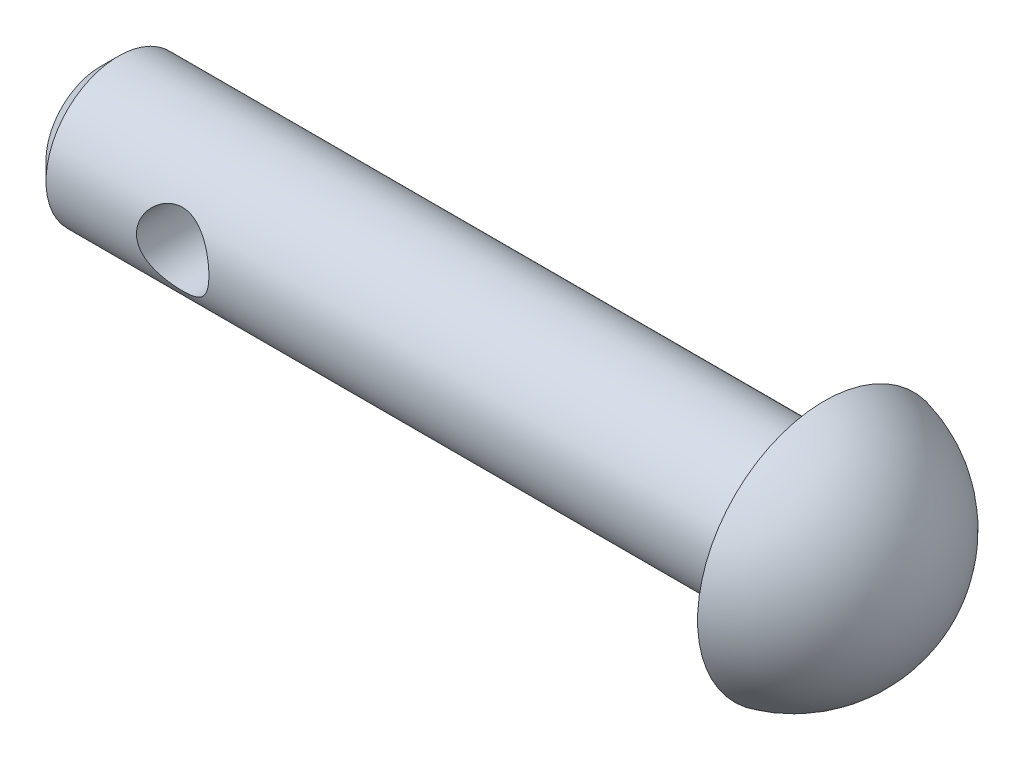
ISO-10303-21;
HEADER;
FILE_DESCRIPTION(('STEP AP214'),'2;1');
FILE_NAME('part.step','',(''),(''),'','','');
FILE_SCHEMA(('AUTOMOTIVE_DESIGN { 1 0 10303 214 1 1 1 1 }'));
ENDSEC;
DATA;
#1=APPLICATION_CONTEXT('core data for automotive mechanical design processes');
#2=APPLICATION_PROTOCOL_DEFINITION('international standard','automotive_design',2000,#1);
#3=PRODUCT_CONTEXT('',#1,'mechanical');
#4=PRODUCT('Part','Part','',(#3));
#5=PRODUCT_RELATED_PRODUCT_CATEGORY('part','',(#4));
#6=PRODUCT_DEFINITION_FORMATION('','',#4);
#7=PRODUCT_DEFINITION_CONTEXT('part definition',#1,'design');
#8=PRODUCT_DEFINITION('design','',#6,#7);
#9=PRODUCT_DEFINITION_SHAPE('','',#8);
#10=(LENGTH_UNIT() NAMED_UNIT(*) SI_UNIT(.MILLI.,.METRE.));
#11=(NAMED_UNIT(*) PLANE_ANGLE_UNIT() SI_UNIT($,.RADIAN.));
#12=(NAMED_UNIT(*) SI_UNIT($,.STERADIAN.) SOLID_ANGLE_UNIT());
#13=UNCERTAINTY_MEASURE_WITH_UNIT(LENGTH_MEASURE(1.E-05),#10,'distance_accuracy_value','');
#14=(GEOMETRIC_REPRESENTATION_CONTEXT(3) GLOBAL_UNCERTAINTY_ASSIGNED_CONTEXT((#13)) GLOBAL_UNIT_ASSIGNED_CONTEXT((#10,
#11,#12)) REPRESENTATION_CONTEXT('',''));
#15=CARTESIAN_POINT('',(0.,0.,0.));
#16=DIRECTION('',(0.,0.,1.));
#17=DIRECTION('',(1.,0.,0.));
#18=AXIS2_PLACEMENT_3D('',#15,#16,#17);
#19=CARTESIAN_POINT('',(-20.,0.,0.));
#20=DIRECTION('',(1.,0.,0.));
#21=DIRECTION('',(0.,0.,-1.));
#22=AXIS2_PLACEMENT_3D('',#19,#20,#21);
#23=CYLINDRICAL_SURFACE('',#22,2.);
#24=CARTESIAN_POINT('',(-19.5,0.,0.));
#25=DIRECTION('',(1.,0.,0.));
#26=DIRECTION('',(0.,0.,-1.));
#27=AXIS2_PLACEMENT_3D('',#24,#25,#26);
#28=CIRCLE('',#27,2.);
#29=CARTESIAN_POINT('',(-19.5,0.,-2.));
#30=VERTEX_POINT('',#29);
#31=EDGE_CURVE('E39',#30,#30,#28,.T.);
#32=ORIENTED_EDGE('',*,*,#31,.T.);
#33=EDGE_LOOP('',(#32));
#34=FACE_BOUND('',#33,.T.);
#35=CARTESIAN_POINT('',(-15.,0.,-2.));
#36=CARTESIAN_POINT('',(-15.0000033023195,-0.0525719629529865,-1.99999713404151));
#37=CARTESIAN_POINT('',(-15.0041700731217,-0.105206599698033,-1.99790491019518));
#38=CARTESIAN_POINT('',(-15.0206528803409,-0.208920235268425,-1.98974156037396));
#39=CARTESIAN_POINT('',(-15.0329843929976,-0.259996086713504,-1.98366287828984));
#40=CARTESIAN_POINT('',(-15.0651938086168,-0.358933544880575,-1.96816279403312));
#41=CARTESIAN_POINT('',(-15.085042384248,-0.406806802939181,-1.9587543917752));
#42=CARTESIAN_POINT('',(-15.1315706213649,-0.498472616806566,-1.93745776515779));
#43=CARTESIAN_POINT('',(-15.1582497442489,-0.54226549399005,-1.9255697363353));
#44=CARTESIAN_POINT('',(-15.2195172494853,-0.62750781776192,-1.89956258258057));
#45=CARTESIAN_POINT('',(-15.2544864792396,-0.668655211122113,-1.88535199127536));
#46=CARTESIAN_POINT('',(-15.330521479247,-0.744779444866978,-1.85659970246744));
#47=CARTESIAN_POINT('',(-15.3715918517724,-0.779751583106767,-1.84205776209035));
#48=CARTESIAN_POINT('',(-15.4624833495234,-0.84525200045028,-1.81298951197347));
#49=CARTESIAN_POINT('',(-15.5127360983459,-0.875225335551638,-1.79855186970132));
#50=CARTESIAN_POINT('',(-15.6183673359862,-0.926168226890696,-1.77285978772321));
#51=CARTESIAN_POINT('',(-15.6737421287227,-0.947144214966335,-1.7616030760699));
#52=CARTESIAN_POINT('',(-15.7846651054219,-0.97813244218859,-1.74457867037808));
#53=CARTESIAN_POINT('',(-15.8400044520674,-0.988725857080443,-1.73852271583713));
#54=CARTESIAN_POINT('',(-15.9519788377795,-1.00042699330885,-1.73181889948528));
#55=CARTESIAN_POINT('',(-16.0086125408712,-1.00154408837308,-1.73116569343288));
#56=CARTESIAN_POINT('',(-16.1142860243154,-0.994687287172296,-1.73510930257248));
#57=CARTESIAN_POINT('',(-16.163424031223,-0.987784559536823,-1.73908763662013));
#58=CARTESIAN_POINT('',(-16.259721909373,-0.966939849056935,-1.7507622873385));
#59=CARTESIAN_POINT('',(-16.3068811453053,-0.952995623897654,-1.75845978831776));
#60=CARTESIAN_POINT('',(-16.3992291325657,-0.918209780386006,-1.77687476412741));
#61=CARTESIAN_POINT('',(-16.4443463987858,-0.897215067115997,-1.78765840663998));
#62=CARTESIAN_POINT('',(-16.53063429259,-0.849041687668004,-1.81103404281404));
#63=CARTESIAN_POINT('',(-16.5718031356001,-0.821860243812469,-1.8236268478019));
#64=CARTESIAN_POINT('',(-16.6545212527432,-0.75806605491279,-1.85113157903286));
#65=CARTESIAN_POINT('',(-16.6954568735762,-0.720694458369283,-1.86613510236746));
#66=CARTESIAN_POINT('',(-16.7707354185909,-0.639555578741374,-1.89547623300407));
#67=CARTESIAN_POINT('',(-16.8050751920339,-0.595785256574287,-1.90981351958801));
#68=CARTESIAN_POINT('',(-16.8676856610297,-0.50051650583185,-1.93701987282964));
#69=CARTESIAN_POINT('',(-16.8956004724457,-0.448753591599411,-1.94978984162007));
#70=CARTESIAN_POINT('',(-16.942097029043,-0.340466215488799,-1.97157881121242));
#71=CARTESIAN_POINT('',(-16.9606861850152,-0.283945576265279,-1.98060078943553));
#72=CARTESIAN_POINT('',(-16.9864754037167,-0.172766491660705,-1.99324333741436));
#73=CARTESIAN_POINT('',(-16.9944912357468,-0.118341530548327,-1.99724938301312));
#74=CARTESIAN_POINT('',(-17.0014647311345,-0.00877959994935651,-2.00073013459102));
#75=CARTESIAN_POINT('',(-17.0004266856395,0.0463570198698988,-2.00020698721312));
#76=CARTESIAN_POINT('',(-16.9897933115812,0.151232971985991,-1.99491192253441));
#77=CARTESIAN_POINT('',(-16.98086746727,0.201059408049952,-1.9904724568819));
#78=CARTESIAN_POINT('',(-16.9557619281049,0.298406892301915,-1.97822171314819));
#79=CARTESIAN_POINT('',(-16.9395814335466,0.345927685690995,-1.97041006334332));
#80=CARTESIAN_POINT('',(-16.9000015335668,0.438888608449664,-1.95184251413669));
#81=CARTESIAN_POINT('',(-16.8764089498832,0.484230397006153,-1.94100881769939));
#82=CARTESIAN_POINT('',(-16.822892464354,0.570461361698921,-1.91743974317109));
#83=CARTESIAN_POINT('',(-16.7929658654066,0.611348629775281,-1.90470355565785));
#84=CARTESIAN_POINT('',(-16.7242395746671,0.691767689290653,-1.87708221337464));
#85=CARTESIAN_POINT('',(-16.6848571315464,0.730772077824639,-1.86210884848441));
#86=CARTESIAN_POINT('',(-16.6000748487307,0.80185632111324,-1.83262391603874));
#87=CARTESIAN_POINT('',(-16.5546708811836,0.833931385690841,-1.81811267381526));
#88=CARTESIAN_POINT('',(-16.4563563457997,0.891707914497694,-1.79051192226068));
#89=CARTESIAN_POINT('',(-16.4031887337914,0.917025495878636,-1.77752529663472));
#90=CARTESIAN_POINT('',(-16.2924899323075,0.958082826013803,-1.75574072368126));
#91=CARTESIAN_POINT('',(-16.2349644734988,0.97383491588757,-1.74693738240618));
#92=CARTESIAN_POINT('',(-16.1230897771386,0.99386168744968,-1.73561501008667));
#93=CARTESIAN_POINT('',(-16.068965746571,0.999092996400866,-1.73257383460491));
#94=CARTESIAN_POINT('',(-15.9605529328293,1.00068915438079,-1.73165354646175));
#95=CARTESIAN_POINT('',(-15.9062642312606,0.997057846624401,-1.73377219627552));
#96=CARTESIAN_POINT('',(-15.804516498468,0.981926125592265,-1.74237862050025));
#97=CARTESIAN_POINT('',(-15.7568995298556,0.971208314342801,-1.74843094482394));
#98=CARTESIAN_POINT('',(-15.6641918805753,0.943175358224647,-1.76371016187917));
#99=CARTESIAN_POINT('',(-15.619102017908,0.925858091159812,-1.77293807569675));
#100=CARTESIAN_POINT('',(-15.5293751490134,0.883815745300685,-1.79428530364528));
#101=CARTESIAN_POINT('',(-15.4849720981703,0.85867113781646,-1.8065572239619));
#102=CARTESIAN_POINT('',(-15.4007254638194,0.802150971636636,-1.8323533163459));
#103=CARTESIAN_POINT('',(-15.3608842694815,0.77077217123865,-1.84587813794522));
#104=CARTESIAN_POINT('',(-15.2818580176424,0.698203326664643,-1.87462323159313));
#105=CARTESIAN_POINT('',(-15.2433408976381,0.656284423010173,-1.88984983311469));
#106=CARTESIAN_POINT('',(-15.1737370165764,0.566154806220281,-1.91877752255088));
#107=CARTESIAN_POINT('',(-15.1426542605737,0.517940723256786,-1.9324777860804));
#108=CARTESIAN_POINT('',(-15.0887636372378,0.415931596819949,-1.95698009585103));
#109=CARTESIAN_POINT('',(-15.0660158305886,0.362099503934616,-1.96776096562909));
#110=CARTESIAN_POINT('',(-15.030191832081,0.250742101294193,-1.98501341363465));
#111=CARTESIAN_POINT('',(-15.0170881531704,0.193227799623168,-1.99149723372932));
#112=CARTESIAN_POINT('',(-15.0061025889241,0.112601946483386,-1.99695461909663));
#113=CARTESIAN_POINT('',(-15.0038173591364,0.0901618794395003,-1.99809365339202));
#114=CARTESIAN_POINT('',(-15.0007653344832,0.0451517318071585,-1.99961696977865));
#115=CARTESIAN_POINT('',(-14.9999985815288,0.0225816476473818,-2.00000123103763));
#116=CARTESIAN_POINT('',(-15.,0.,-2.));
#117=B_SPLINE_CURVE_WITH_KNOTS('',3,(#35,#36,#37,#38,#39,#40,#41,#42,#43,#44,#45,#46,#47,#48,
#49,#50,#51,#52,#53,#54,#55,#56,#57,#58,#59,#60,#61,#62,#63,#64,#65,#66,#67,#68,#69,#70,#71,#72,
#73,#74,#75,#76,#77,#78,#79,#80,#81,#82,#83,#84,#85,#86,#87,#88,#89,#90,#91,#92,#93,#94,#95,#96,
#97,#98,#99,#100,#101,#102,#103,#104,#105,#106,#107,#108,#109,#110,#111,#112,#113,#114,#115,
#116),.UNSPECIFIED.,.T.,.F.,(4,2,2,2,2,2,2,2,2,2,2,2,2,2,2,2,2,2,2,2,2,2,2,2,2,2,2,2,2,2,2,2,2,
2,2,2,2,2,2,2,4),(0.,0.157624257420293,0.315548149709198,0.472862155492299,0.630163760581568,
0.79698175871809,0.963926237654036,1.14381726430753,1.32357947898281,1.4925801214023,
1.6614135732902,1.8100571240932,1.95874803925678,2.11090240168487,2.26312521260222,
2.43464941333879,2.60625534598687,2.78583022214441,2.9652621691228,3.12983290471346,
3.29432564511476,3.44606906506122,3.59782921630932,3.75392856027899,3.9100945074834,
4.08159610644419,4.25321588615432,4.43314682159674,4.61284511940778,4.77529307498374,
4.93767059860006,5.08457930244183,5.23153528783678,5.38836456775615,5.54527561138958,
5.72125242752499,5.89732383376573,6.07464013662926,6.25144908624931,6.31915280137698,
6.38685838514848),.UNSPECIFIED.);
#118=CARTESIAN_POINT('',(-15.,0.,-2.));
#119=VERTEX_POINT('',#118);
#120=EDGE_CURVE('E43',#119,#119,#117,.T.);
#121=ORIENTED_EDGE('',*,*,#120,.F.);
#122=EDGE_LOOP('',(#121));
#123=FACE_BOUND('',#122,.T.);
#124=CARTESIAN_POINT('',(-15.,0.,2.));
#125=CARTESIAN_POINT('',(-15.0000033023195,0.0525719629529865,1.99999713404151));
#126=CARTESIAN_POINT('',(-15.0041700731217,0.105206599698033,1.99790491019518));
#127=CARTESIAN_POINT('',(-15.0206528803409,0.208920235268425,1.98974156037396));
#128=CARTESIAN_POINT('',(-15.0329843929976,0.259996086713504,1.98366287828984));
#129=CARTESIAN_POINT('',(-15.0651938086168,0.358933544880575,1.96816279403312));
#130=CARTESIAN_POINT('',(-15.085042384248,0.406806802939181,1.9587543917752));
#131=CARTESIAN_POINT('',(-15.1315706213649,0.498472616806566,1.93745776515779));
#132=CARTESIAN_POINT('',(-15.1582497442489,0.54226549399005,1.9255697363353));
#133=CARTESIAN_POINT('',(-15.2195172494853,0.62750781776192,1.89956258258057));
#134=CARTESIAN_POINT('',(-15.2544864792396,0.668655211122113,1.88535199127536));
#135=CARTESIAN_POINT('',(-15.330521479247,0.744779444866978,1.85659970246744));
#136=CARTESIAN_POINT('',(-15.3715918517724,0.779751583106767,1.84205776209035));
#137=CARTESIAN_POINT('',(-15.4624833495234,0.84525200045028,1.81298951197347));
#138=CARTESIAN_POINT('',(-15.5127360983459,0.875225335551638,1.79855186970132));
#139=CARTESIAN_POINT('',(-15.6183673359862,0.926168226890696,1.77285978772321));
#140=CARTESIAN_POINT('',(-15.6737421287227,0.947144214966335,1.7616030760699));
#141=CARTESIAN_POINT('',(-15.7846651054219,0.97813244218859,1.74457867037808));
#142=CARTESIAN_POINT('',(-15.8400044520674,0.988725857080443,1.73852271583713));
#143=CARTESIAN_POINT('',(-15.9519788377795,1.00042699330885,1.73181889948528));
#144=CARTESIAN_POINT('',(-16.0086125408712,1.00154408837308,1.73116569343288));
#145=CARTESIAN_POINT('',(-16.1142860243154,0.994687287172296,1.73510930257248));
#146=CARTESIAN_POINT('',(-16.163424031223,0.987784559536823,1.73908763662013));
#147=CARTESIAN_POINT('',(-16.259721909373,0.966939849056935,1.7507622873385));
#148=CARTESIAN_POINT('',(-16.3068811453053,0.952995623897654,1.75845978831776));
#149=CARTESIAN_POINT('',(-16.3992291325657,0.918209780386006,1.77687476412741));
#150=CARTESIAN_POINT('',(-16.4443463987858,0.897215067115997,1.78765840663998));
#151=CARTESIAN_POINT('',(-16.53063429259,0.849041687668004,1.81103404281404));
#152=CARTESIAN_POINT('',(-16.5718031356001,0.821860243812469,1.8236268478019));
#153=CARTESIAN_POINT('',(-16.6545212527432,0.75806605491279,1.85113157903286));
#154=CARTESIAN_POINT('',(-16.6954568735762,0.720694458369283,1.86613510236746));
#155=CARTESIAN_POINT('',(-16.7707354185909,0.639555578741374,1.89547623300407));
#156=CARTESIAN_POINT('',(-16.8050751920339,0.595785256574287,1.90981351958801));
#157=CARTESIAN_POINT('',(-16.8676856610297,0.50051650583185,1.93701987282964));
#158=CARTESIAN_POINT('',(-16.8956004724457,0.448753591599411,1.94978984162007));
#159=CARTESIAN_POINT('',(-16.942097029043,0.340466215488799,1.97157881121242));
#160=CARTESIAN_POINT('',(-16.9606861850152,0.283945576265279,1.98060078943553));
#161=CARTESIAN_POINT('',(-16.9864754037167,0.172766491660705,1.99324333741436));
#162=CARTESIAN_POINT('',(-16.9944912357468,0.118341530548327,1.99724938301312));
#163=CARTESIAN_POINT('',(-17.0014647311345,0.00877959994935651,2.00073013459102));
#164=CARTESIAN_POINT('',(-17.0004266856395,-0.0463570198698988,2.00020698721312));
#165=CARTESIAN_POINT('',(-16.9897933115812,-0.151232971985991,1.99491192253441));
#166=CARTESIAN_POINT('',(-16.98086746727,-0.201059408049952,1.9904724568819));
#167=CARTESIAN_POINT('',(-16.9557619281049,-0.298406892301915,1.97822171314819));
#168=CARTESIAN_POINT('',(-16.9395814335466,-0.345927685690995,1.97041006334332));
#169=CARTESIAN_POINT('',(-16.9000015335668,-0.438888608449664,1.95184251413669));
#170=CARTESIAN_POINT('',(-16.8764089498832,-0.484230397006153,1.94100881769939));
#171=CARTESIAN_POINT('',(-16.822892464354,-0.570461361698921,1.91743974317109));
#172=CARTESIAN_POINT('',(-16.7929658654066,-0.611348629775281,1.90470355565785));
#173=CARTESIAN_POINT('',(-16.7242395746671,-0.691767689290653,1.87708221337464));
#174=CARTESIAN_POINT('',(-16.6848571315464,-0.730772077824639,1.86210884848441));
#175=CARTESIAN_POINT('',(-16.6000748487307,-0.80185632111324,1.83262391603874));
#176=CARTESIAN_POINT('',(-16.5546708811836,-0.833931385690841,1.81811267381526));
#177=CARTESIAN_POINT('',(-16.4563563457997,-0.891707914497694,1.79051192226068));
#178=CARTESIAN_POINT('',(-16.4031887337914,-0.917025495878636,1.77752529663472));
#179=CARTESIAN_POINT('',(-16.2924899323075,-0.958082826013803,1.75574072368126));
#180=CARTESIAN_POINT('',(-16.2349644734988,-0.97383491588757,1.74693738240618));
#181=CARTESIAN_POINT('',(-16.1230897771386,-0.99386168744968,1.73561501008667));
#182=CARTESIAN_POINT('',(-16.068965746571,-0.999092996400866,1.73257383460491));
#183=CARTESIAN_POINT('',(-15.9605529328293,-1.00068915438079,1.73165354646175));
#184=CARTESIAN_POINT('',(-15.9062642312606,-0.997057846624401,1.73377219627552));
#185=CARTESIAN_POINT('',(-15.804516498468,-0.981926125592265,1.74237862050025));
#186=CARTESIAN_POINT('',(-15.7568995298556,-0.971208314342801,1.74843094482394));
#187=CARTESIAN_POINT('',(-15.6641918805753,-0.943175358224647,1.76371016187917));
#188=CARTESIAN_POINT('',(-15.619102017908,-0.925858091159812,1.77293807569675));
#189=CARTESIAN_POINT('',(-15.5293751490134,-0.883815745300685,1.79428530364528));
#190=CARTESIAN_POINT('',(-15.4849720981703,-0.85867113781646,1.8065572239619));
#191=CARTESIAN_POINT('',(-15.4007254638194,-0.802150971636636,1.8323533163459));
#192=CARTESIAN_POINT('',(-15.3608842694815,-0.77077217123865,1.84587813794522));
#193=CARTESIAN_POINT('',(-15.2818580176424,-0.698203326664643,1.87462323159313));
#194=CARTESIAN_POINT('',(-15.2433408976381,-0.656284423010173,1.88984983311469));
#195=CARTESIAN_POINT('',(-15.1737370165764,-0.566154806220281,1.91877752255088));
#196=CARTESIAN_POINT('',(-15.1426542605737,-0.517940723256786,1.9324777860804));
#197=CARTESIAN_POINT('',(-15.0887636372378,-0.415931596819949,1.95698009585103));
#198=CARTESIAN_POINT('',(-15.0660158305886,-0.362099503934616,1.96776096562909));
#199=CARTESIAN_POINT('',(-15.030191832081,-0.250742101294193,1.98501341363465));
#200=CARTESIAN_POINT('',(-15.0170881531704,-0.193227799623168,1.99149723372932));
#201=CARTESIAN_POINT('',(-15.0061025889241,-0.112601946483386,1.99695461909663));
#202=CARTESIAN_POINT('',(-15.0038173591364,-0.0901618794395003,1.99809365339202));
#203=CARTESIAN_POINT('',(-15.0007653344832,-0.0451517318071585,1.99961696977865));
#204=CARTESIAN_POINT('',(-14.9999985815288,-0.0225816476473818,2.00000123103763));
#205=CARTESIAN_POINT('',(-15.,0.,2.));
#206=B_SPLINE_CURVE_WITH_KNOTS('',3,(#124,#125,#126,#127,#128,#129,#130,#131,#132,#133,#134,
#135,#136,#137,#138,#139,#140,#141,#142,#143,#144,#145,#146,#147,#148,#149,#150,#151,#152,#153,
#154,#155,#156,#157,#158,#159,#160,#161,#162,#163,#164,#165,#166,#167,#168,#169,#170,#171,#172,
#173,#174,#175,#176,#177,#178,#179,#180,#181,#182,#183,#184,#185,#186,#187,#188,#189,#190,#191,
#192,#193,#194,#195,#196,#197,#198,#199,#200,#201,#202,#203,#204,#205),.UNSPECIFIED.,.T.,.F.,(4,
2,2,2,2,2,2,2,2,2,2,2,2,2,2,2,2,2,2,2,2,2,2,2,2,2,2,2,2,2,2,2,2,2,2,2,2,2,2,2,4),(0.,
0.157624257420293,0.315548149709198,0.472862155492299,0.630163760581568,0.79698175871809,
0.963926237654036,1.14381726430753,1.32357947898281,1.4925801214023,1.6614135732902,
1.8100571240932,1.95874803925678,2.11090240168487,2.26312521260222,2.43464941333879,
2.60625534598687,2.78583022214441,2.9652621691228,3.12983290471346,3.29432564511476,
3.44606906506122,3.59782921630932,3.75392856027899,3.9100945074834,4.08159610644419,
4.25321588615432,4.43314682159674,4.61284511940778,4.77529307498374,4.93767059860006,
5.08457930244183,5.23153528783678,5.38836456775615,5.54527561138958,5.72125242752499,
5.89732383376573,6.07464013662926,6.25144908624931,6.31915280137698,6.38685838514848),.UNSPECIFIED.);
#207=CARTESIAN_POINT('',(-15.,0.,2.));
#208=VERTEX_POINT('',#207);
#209=EDGE_CURVE('E47',#208,#208,#206,.T.);
#210=ORIENTED_EDGE('',*,*,#209,.F.);
#211=EDGE_LOOP('',(#210));
#212=FACE_BOUND('',#211,.T.);
#213=CARTESIAN_POINT('',(0.,0.,0.));
#214=DIRECTION('',(1.,0.,0.));
#215=DIRECTION('',(0.,0.,-1.));
#216=AXIS2_PLACEMENT_3D('',#213,#214,#215);
#217=CIRCLE('',#216,2.);
#218=CARTESIAN_POINT('',(0.,0.,-2.));
#219=VERTEX_POINT('',#218);
#220=EDGE_CURVE('E83',#219,#219,#217,.T.);
#221=ORIENTED_EDGE('',*,*,#220,.F.);
#222=EDGE_LOOP('',(#221));
#223=FACE_BOUND('',#222,.T.);
#224=ADVANCED_FACE('F32',(#34,#123,#212,#223),#23,.T.);
#225=CARTESIAN_POINT('',(-20.,0.,0.));
#226=DIRECTION('',(1.,0.,0.));
#227=DIRECTION('',(0.,0.,-1.));
#228=AXIS2_PLACEMENT_3D('',#225,#226,#227);
#229=PLANE('',#228);
#230=CARTESIAN_POINT('',(-20.,0.,0.));
#231=DIRECTION('',(1.,0.,0.));
#232=DIRECTION('',(0.,0.,-1.));
#233=AXIS2_PLACEMENT_3D('',#230,#231,#232);
#234=CIRCLE('',#233,1.49999999999999);
#235=CARTESIAN_POINT('',(-20.,0.,-1.49999999999999));
#236=VERTEX_POINT('',#235);
#237=EDGE_CURVE('E10',#236,#236,#234,.F.);
#238=ORIENTED_EDGE('',*,*,#237,.T.);
#239=EDGE_LOOP('',(#238));
#240=FACE_BOUND('',#239,.T.);
#241=ADVANCED_FACE('F64',(#240),#229,.F.);
#242=CARTESIAN_POINT('',(-16.,0.,-2.));
#243=DIRECTION('',(0.,0.,1.));
#244=DIRECTION('',(1.,0.,0.));
#245=AXIS2_PLACEMENT_3D('',#242,#243,#244);
#246=CYLINDRICAL_SURFACE('',#245,1.);
#247=ORIENTED_EDGE('',*,*,#120,.T.);
#248=EDGE_LOOP('',(#247));
#249=FACE_BOUND('',#248,.T.);
#250=ORIENTED_EDGE('',*,*,#209,.T.);
#251=EDGE_LOOP('',(#250));
#252=FACE_BOUND('',#251,.T.);
#253=ADVANCED_FACE('F60',(#249,#252),#246,.F.);
#254=CARTESIAN_POINT('',(-19.5,0.,0.));
#255=DIRECTION('',(1.,0.,0.));
#256=DIRECTION('',(0.,0.,-1.));
#257=AXIS2_PLACEMENT_3D('',#254,#255,#256);
#258=CONICAL_SURFACE('',#257,2.,0.785398163397452);
#259=ORIENTED_EDGE('',*,*,#237,.F.);
#260=EDGE_LOOP('',(#259));
#261=FACE_BOUND('',#260,.T.);
#262=ORIENTED_EDGE('',*,*,#31,.F.);
#263=EDGE_LOOP('',(#262));
#264=FACE_BOUND('',#263,.T.);
#265=ADVANCED_FACE('F34',(#261,#264),#258,.T.);
#266=CARTESIAN_POINT('',(-0.842614977317633,0.,0.));
#267=DIRECTION('',(1.,0.,0.));
#268=DIRECTION('',(0.,0.,-1.));
#269=AXIS2_PLACEMENT_3D('',#266,#267,#268);
#270=SPHERICAL_SURFACE('',#269,3.6);
#271=CARTESIAN_POINT('',(0.,0.,0.));
#272=DIRECTION('',(1.,0.,0.));
#273=DIRECTION('',(0.,0.,-1.));
#274=AXIS2_PLACEMENT_3D('',#271,#272,#273);
#275=CIRCLE('',#274,3.5);
#276=CARTESIAN_POINT('',(0.,0.,-3.5));
#277=VERTEX_POINT('',#276);
#278=EDGE_CURVE('E85',#277,#277,#275,.T.);
#279=ORIENTED_EDGE('',*,*,#278,.T.);
#280=EDGE_LOOP('',(#279));
#281=FACE_BOUND('',#280,.T.);
#282=ADVANCED_FACE('F66',(#281),#270,.T.);
#283=CARTESIAN_POINT('',(0.,0.,0.));
#284=DIRECTION('',(-1.,0.,0.));
#285=DIRECTION('',(0.,0.,1.));
#286=AXIS2_PLACEMENT_3D('',#283,#284,#285);
#287=PLANE('',#286);
#288=ORIENTED_EDGE('',*,*,#220,.T.);
#289=EDGE_LOOP('',(#288));
#290=FACE_BOUND('',#289,.T.);
#291=ORIENTED_EDGE('',*,*,#278,.F.);
#292=EDGE_LOOP('',(#291));
#293=FACE_BOUND('',#292,.T.);
#294=ADVANCED_FACE('F91',(#290,#293),#287,.T.);
#295=CLOSED_SHELL('',(#224,#241,#253,#265,#282,#294));
#296=MANIFOLD_SOLID_BREP('B2',#295);
#297=ADVANCED_BREP_SHAPE_REPRESENTATION('',(#18,#296),#14);
#298=SHAPE_DEFINITION_REPRESENTATION(#9,#297);
ENDSEC;
END-ISO-10303-21;
